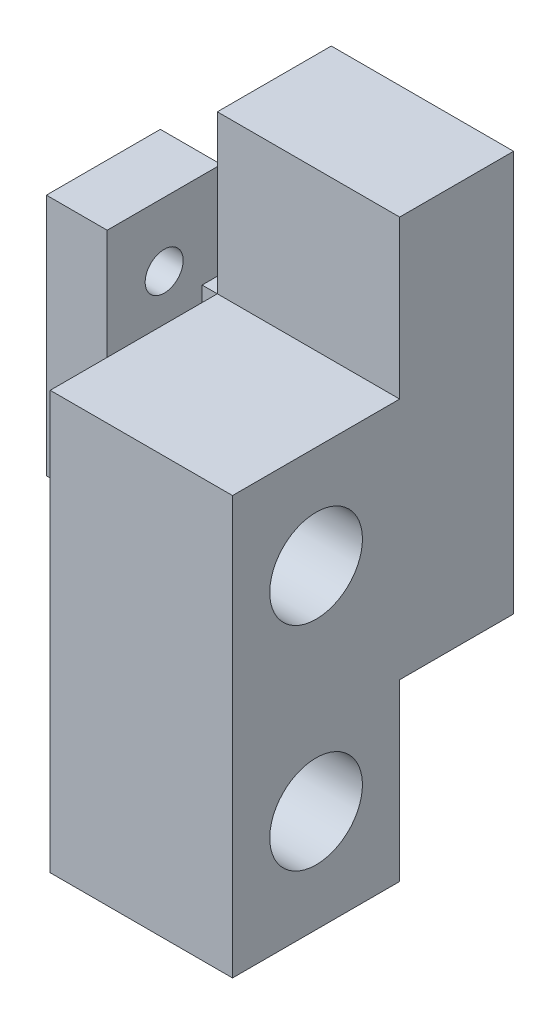
ISO-10303-21;
HEADER;
FILE_DESCRIPTION(('STEP AP214'),'2;1');
FILE_NAME('part.step','',(''),(''),'','','');
FILE_SCHEMA(('AUTOMOTIVE_DESIGN { 1 0 10303 214 1 1 1 1 }'));
ENDSEC;
DATA;
#1=APPLICATION_CONTEXT('core data for automotive mechanical design processes');
#2=APPLICATION_PROTOCOL_DEFINITION('international standard','automotive_design',2000,#1);
#3=PRODUCT_CONTEXT('',#1,'mechanical');
#4=PRODUCT('Part','Part','',(#3));
#5=PRODUCT_RELATED_PRODUCT_CATEGORY('part','',(#4));
#6=PRODUCT_DEFINITION_FORMATION('','',#4);
#7=PRODUCT_DEFINITION_CONTEXT('part definition',#1,'design');
#8=PRODUCT_DEFINITION('design','',#6,#7);
#9=PRODUCT_DEFINITION_SHAPE('','',#8);
#10=(LENGTH_UNIT() NAMED_UNIT(*) SI_UNIT(.MILLI.,.METRE.));
#11=(NAMED_UNIT(*) PLANE_ANGLE_UNIT() SI_UNIT($,.RADIAN.));
#12=(NAMED_UNIT(*) SI_UNIT($,.STERADIAN.) SOLID_ANGLE_UNIT());
#13=UNCERTAINTY_MEASURE_WITH_UNIT(LENGTH_MEASURE(1.E-05),#10,'distance_accuracy_value','');
#14=(GEOMETRIC_REPRESENTATION_CONTEXT(3) GLOBAL_UNCERTAINTY_ASSIGNED_CONTEXT((#13)) GLOBAL_UNIT_ASSIGNED_CONTEXT((#10,
#11,#12)) REPRESENTATION_CONTEXT('',''));
#15=CARTESIAN_POINT('',(0.,0.,0.));
#16=DIRECTION('',(0.,0.,1.));
#17=DIRECTION('',(1.,0.,0.));
#18=AXIS2_PLACEMENT_3D('',#15,#16,#17);
#19=CARTESIAN_POINT('',(0.,0.,15.));
#20=DIRECTION('',(0.,0.,1.));
#21=DIRECTION('',(1.,0.,0.));
#22=AXIS2_PLACEMENT_3D('',#19,#20,#21);
#23=PLANE('',#22);
#24=DIRECTION('',(0.,-1.,0.));
#25=VECTOR('',#24,1.);
#26=CARTESIAN_POINT('',(-49.8004880602594,0.,15.));
#27=LINE('',#26,#25);
#28=CARTESIAN_POINT('',(-49.8004880602594,16.7742765528327,15.));
#29=VERTEX_POINT('',#28);
#30=CARTESIAN_POINT('',(-49.8004880602594,-15.2257234471673,15.));
#31=VERTEX_POINT('',#30);
#32=EDGE_CURVE('E326',#29,#31,#27,.T.);
#33=ORIENTED_EDGE('',*,*,#32,.F.);
#34=DIRECTION('',(-1.,0.,0.));
#35=VECTOR('',#34,1.);
#36=CARTESIAN_POINT('',(-51.8005116722408,16.7742765528327,15.));
#37=LINE('',#36,#35);
#38=CARTESIAN_POINT('',(-51.8005116722408,16.7742765528327,15.));
#39=VERTEX_POINT('',#38);
#40=EDGE_CURVE('E198',#29,#39,#37,.T.);
#41=ORIENTED_EDGE('',*,*,#40,.T.);
#42=DIRECTION('',(0.,-1.,0.));
#43=VECTOR('',#42,1.);
#44=CARTESIAN_POINT('',(-51.8005116722408,-7.22572344716734,15.));
#45=LINE('',#44,#43);
#46=CARTESIAN_POINT('',(-51.8005116722408,-7.22572344716734,15.));
#47=VERTEX_POINT('',#46);
#48=EDGE_CURVE('E222',#39,#47,#45,.T.);
#49=ORIENTED_EDGE('',*,*,#48,.T.);
#50=DIRECTION('',(-1.,0.,0.));
#51=VECTOR('',#50,1.);
#52=CARTESIAN_POINT('',(-64.3005116722456,-7.22572344716734,15.));
#53=LINE('',#52,#51);
#54=CARTESIAN_POINT('',(-64.3005116722456,-7.22572344716734,15.));
#55=VERTEX_POINT('',#54);
#56=EDGE_CURVE('E226',#47,#55,#53,.T.);
#57=ORIENTED_EDGE('',*,*,#56,.T.);
#58=DIRECTION('',(0.,1.,0.));
#59=VECTOR('',#58,1.);
#60=CARTESIAN_POINT('',(-64.3005116722456,16.7742765528327,15.));
#61=LINE('',#60,#59);
#62=CARTESIAN_POINT('',(-64.3005116722456,16.7742765528327,15.));
#63=VERTEX_POINT('',#62);
#64=EDGE_CURVE('E230',#55,#63,#61,.T.);
#65=ORIENTED_EDGE('',*,*,#64,.T.);
#66=DIRECTION('',(-1.,0.,0.));
#67=VECTOR('',#66,1.);
#68=CARTESIAN_POINT('',(-64.3005116722456,16.7742765528327,15.));
#69=LINE('',#68,#67);
#70=CARTESIAN_POINT('',(-72.3005116722456,16.7742765528327,15.));
#71=VERTEX_POINT('',#70);
#72=EDGE_CURVE('E234',#63,#71,#69,.T.);
#73=ORIENTED_EDGE('',*,*,#72,.T.);
#74=DIRECTION('',(0.,-1.,0.));
#75=VECTOR('',#74,1.);
#76=CARTESIAN_POINT('',(-72.3005116722456,16.7742765528327,15.));
#77=LINE('',#76,#75);
#78=CARTESIAN_POINT('',(-72.3005116722456,-15.2257234471673,15.));
#79=VERTEX_POINT('',#78);
#80=EDGE_CURVE('E238',#71,#79,#77,.T.);
#81=ORIENTED_EDGE('',*,*,#80,.T.);
#82=DIRECTION('',(1.,0.,0.));
#83=VECTOR('',#82,1.);
#84=CARTESIAN_POINT('',(-72.3005116722456,-15.2257234471673,15.));
#85=LINE('',#84,#83);
#86=EDGE_CURVE('E242',#79,#31,#85,.T.);
#87=ORIENTED_EDGE('',*,*,#86,.T.);
#88=EDGE_LOOP('',(#33,#41,#49,#57,#65,#73,#81,#87));
#89=FACE_BOUND('',#88,.T.);
#90=ADVANCED_FACE('F45',(#89),#23,.T.);
#91=CARTESIAN_POINT('',(-37.800488060268,25.5242765528339,15.));
#92=DIRECTION('',(0.,0.,-1.));
#93=DIRECTION('',(-1.,0.,0.));
#94=AXIS2_PLACEMENT_3D('',#91,#92,#93);
#95=CYLINDRICAL_SURFACE('',#94,3.1);
#96=CARTESIAN_POINT('',(-37.800488060268,25.5242765528339,0.));
#97=DIRECTION('',(0.,0.,1.));
#98=DIRECTION('',(1.,0.,0.));
#99=AXIS2_PLACEMENT_3D('',#96,#97,#98);
#100=CIRCLE('',#99,3.1);
#101=CARTESIAN_POINT('',(-34.700488060268,25.5242765528339,0.));
#102=VERTEX_POINT('',#101);
#103=EDGE_CURVE('E276',#102,#102,#100,.T.);
#104=ORIENTED_EDGE('',*,*,#103,.F.);
#105=EDGE_LOOP('',(#104));
#106=FACE_BOUND('',#105,.T.);
#107=CARTESIAN_POINT('',(-37.800488060268,25.5242765528339,10.));
#108=DIRECTION('',(0.,0.,1.));
#109=DIRECTION('',(1.,0.,0.));
#110=AXIS2_PLACEMENT_3D('',#107,#108,#109);
#111=CIRCLE('',#110,3.1);
#112=CARTESIAN_POINT('',(-34.700488060268,25.5242765528339,10.));
#113=VERTEX_POINT('',#112);
#114=EDGE_CURVE('E268',#113,#113,#111,.T.);
#115=ORIENTED_EDGE('',*,*,#114,.T.);
#116=EDGE_LOOP('',(#115));
#117=FACE_BOUND('',#116,.T.);
#118=ADVANCED_FACE('F47',(#106,#117),#95,.F.);
#119=CARTESIAN_POINT('',(-37.8004880602594,-2.97572344716154,15.));
#120=DIRECTION('',(0.,0.,-1.));
#121=DIRECTION('',(-1.,0.,0.));
#122=AXIS2_PLACEMENT_3D('',#119,#120,#121);
#123=CYLINDRICAL_SURFACE('',#122,3.1);
#124=CARTESIAN_POINT('',(-37.8004880602594,-2.97572344716154,0.));
#125=DIRECTION('',(0.,0.,1.));
#126=DIRECTION('',(1.,0.,0.));
#127=AXIS2_PLACEMENT_3D('',#124,#125,#126);
#128=CIRCLE('',#127,3.1);
#129=CARTESIAN_POINT('',(-34.7004880602594,-2.97572344716154,0.));
#130=VERTEX_POINT('',#129);
#131=EDGE_CURVE('E289',#130,#130,#128,.T.);
#132=ORIENTED_EDGE('',*,*,#131,.F.);
#133=EDGE_LOOP('',(#132));
#134=FACE_BOUND('',#133,.T.);
#135=CARTESIAN_POINT('',(-37.8004880602594,-2.97572344716154,10.));
#136=DIRECTION('',(0.,0.,1.));
#137=DIRECTION('',(1.,0.,0.));
#138=AXIS2_PLACEMENT_3D('',#135,#136,#137);
#139=CIRCLE('',#138,3.1);
#140=CARTESIAN_POINT('',(-34.7004880602594,-2.97572344716154,10.));
#141=VERTEX_POINT('',#140);
#142=EDGE_CURVE('E272',#141,#141,#139,.T.);
#143=ORIENTED_EDGE('',*,*,#142,.T.);
#144=EDGE_LOOP('',(#143));
#145=FACE_BOUND('',#144,.T.);
#146=ADVANCED_FACE('F400',(#134,#145),#123,.F.);
#147=CARTESIAN_POINT('',(-25.8004880602594,0.,15.));
#148=DIRECTION('',(-1.,0.,0.));
#149=DIRECTION('',(0.,-1.,0.));
#150=AXIS2_PLACEMENT_3D('',#147,#148,#149);
#151=PLANE('',#150);
#152=CARTESIAN_POINT('',(-25.8004880602594,3.27427655283267,26.));
#153=DIRECTION('',(-1.,0.,0.));
#154=DIRECTION('',(0.,-1.,0.));
#155=AXIS2_PLACEMENT_3D('',#152,#153,#154);
#156=CIRCLE('',#155,6.1);
#157=CARTESIAN_POINT('',(-25.8004880602594,-2.82572344716733,26.));
#158=VERTEX_POINT('',#157);
#159=EDGE_CURVE('E346',#158,#158,#156,.T.);
#160=ORIENTED_EDGE('',*,*,#159,.T.);
#161=EDGE_LOOP('',(#160));
#162=FACE_BOUND('',#161,.T.);
#163=CARTESIAN_POINT('',(-25.8004880602594,-24.7257234471673,26.));
#164=DIRECTION('',(-1.,0.,0.));
#165=DIRECTION('',(0.,-1.,0.));
#166=AXIS2_PLACEMENT_3D('',#163,#164,#165);
#167=CIRCLE('',#166,6.1);
#168=CARTESIAN_POINT('',(-25.8004880602594,-30.8257234471673,26.));
#169=VERTEX_POINT('',#168);
#170=EDGE_CURVE('E510',#169,#169,#167,.T.);
#171=ORIENTED_EDGE('',*,*,#170,.T.);
#172=EDGE_LOOP('',(#171));
#173=FACE_BOUND('',#172,.T.);
#174=DIRECTION('',(0.,1.,0.));
#175=VECTOR('',#174,1.);
#176=CARTESIAN_POINT('',(-25.8004880602594,0.,0.));
#177=LINE('',#176,#175);
#178=CARTESIAN_POINT('',(-25.8004880602594,-15.2257234471673,0.));
#179=VERTEX_POINT('',#178);
#180=CARTESIAN_POINT('',(-25.8004880602594,37.5242765528386,0.));
#181=VERTEX_POINT('',#180);
#182=EDGE_CURVE('E293',#179,#181,#177,.T.);
#183=ORIENTED_EDGE('',*,*,#182,.T.);
#184=DIRECTION('',(0.,0.,-1.));
#185=VECTOR('',#184,1.);
#186=CARTESIAN_POINT('',(-25.8004880602594,37.5242765528386,15.));
#187=LINE('',#186,#185);
#188=CARTESIAN_POINT('',(-25.8004880602594,37.5242765528386,15.));
#189=VERTEX_POINT('',#188);
#190=EDGE_CURVE('E11',#189,#181,#187,.T.);
#191=ORIENTED_EDGE('',*,*,#190,.F.);
#192=DIRECTION('',(0.,1.,0.));
#193=VECTOR('',#192,1.);
#194=CARTESIAN_POINT('',(-25.8004880602594,0.,15.));
#195=LINE('',#194,#193);
#196=CARTESIAN_POINT('',(-25.8004880602594,16.7742765528327,15.));
#197=VERTEX_POINT('',#196);
#198=EDGE_CURVE('E175',#197,#189,#195,.T.);
#199=ORIENTED_EDGE('',*,*,#198,.F.);
#200=DIRECTION('',(0.,0.,-1.));
#201=VECTOR('',#200,1.);
#202=CARTESIAN_POINT('',(-25.8004880602594,16.7742765528327,37.));
#203=LINE('',#202,#201);
#204=CARTESIAN_POINT('',(-25.8004880602594,16.7742765528327,37.));
#205=VERTEX_POINT('',#204);
#206=EDGE_CURVE('E153',#205,#197,#203,.T.);
#207=ORIENTED_EDGE('',*,*,#206,.F.);
#208=DIRECTION('',(0.,1.,0.));
#209=VECTOR('',#208,1.);
#210=CARTESIAN_POINT('',(-25.8004880602594,0.,37.));
#211=LINE('',#210,#209);
#212=CARTESIAN_POINT('',(-25.8004880602594,-38.2257234471673,37.));
#213=VERTEX_POINT('',#212);
#214=EDGE_CURVE('E160',#213,#205,#211,.T.);
#215=ORIENTED_EDGE('',*,*,#214,.F.);
#216=DIRECTION('',(0.,0.,-1.));
#217=VECTOR('',#216,1.);
#218=CARTESIAN_POINT('',(-25.8004880602594,-38.2257234471673,37.));
#219=LINE('',#218,#217);
#220=CARTESIAN_POINT('',(-25.8004880602594,-38.2257234471673,15.));
#221=VERTEX_POINT('',#220);
#222=EDGE_CURVE('E341',#213,#221,#219,.T.);
#223=ORIENTED_EDGE('',*,*,#222,.T.);
#224=DIRECTION('',(0.,1.,0.));
#225=VECTOR('',#224,1.);
#226=CARTESIAN_POINT('',(-25.8004880602594,0.,15.));
#227=LINE('',#226,#225);
#228=CARTESIAN_POINT('',(-25.8004880602594,-15.2257234471673,15.));
#229=VERTEX_POINT('',#228);
#230=EDGE_CURVE('E333',#221,#229,#227,.T.);
#231=ORIENTED_EDGE('',*,*,#230,.T.);
#232=DIRECTION('',(0.,0.,1.));
#233=VECTOR('',#232,1.);
#234=CARTESIAN_POINT('',(-25.8004880602594,-15.2257234471673,-24.001302048014));
#235=LINE('',#234,#233);
#236=EDGE_CURVE('E177',#179,#229,#235,.T.);
#237=ORIENTED_EDGE('',*,*,#236,.F.);
#238=EDGE_LOOP('',(#183,#191,#199,#207,#215,#223,#231,#237));
#239=FACE_BOUND('',#238,.T.);
#240=ADVANCED_FACE('F173',(#162,#173,#239),#151,.F.);
#241=CARTESIAN_POINT('',(0.,37.5242765528386,15.));
#242=DIRECTION('',(0.,-1.,0.));
#243=DIRECTION('',(0.,0.,-1.));
#244=AXIS2_PLACEMENT_3D('',#241,#242,#243);
#245=PLANE('',#244);
#246=DIRECTION('',(-1.,0.,0.));
#247=VECTOR('',#246,1.);
#248=CARTESIAN_POINT('',(0.,37.5242765528386,0.));
#249=LINE('',#248,#247);
#250=CARTESIAN_POINT('',(-49.8004880602594,37.5242765528386,0.));
#251=VERTEX_POINT('',#250);
#252=EDGE_CURVE('E296',#181,#251,#249,.T.);
#253=ORIENTED_EDGE('',*,*,#252,.T.);
#254=DIRECTION('',(0.,0.,-1.));
#255=VECTOR('',#254,1.);
#256=CARTESIAN_POINT('',(-49.8004880602594,37.5242765528386,15.));
#257=LINE('',#256,#255);
#258=CARTESIAN_POINT('',(-49.8004880602594,37.5242765528386,15.));
#259=VERTEX_POINT('',#258);
#260=EDGE_CURVE('E55',#259,#251,#257,.T.);
#261=ORIENTED_EDGE('',*,*,#260,.F.);
#262=DIRECTION('',(-1.,0.,0.));
#263=VECTOR('',#262,1.);
#264=CARTESIAN_POINT('',(0.,37.5242765528386,15.));
#265=LINE('',#264,#263);
#266=EDGE_CURVE('E279',#189,#259,#265,.T.);
#267=ORIENTED_EDGE('',*,*,#266,.F.);
#268=ORIENTED_EDGE('',*,*,#190,.T.);
#269=EDGE_LOOP('',(#253,#261,#267,#268));
#270=FACE_BOUND('',#269,.T.);
#271=ADVANCED_FACE('F410',(#270),#245,.F.);
#272=CARTESIAN_POINT('',(-49.8004880602594,0.,15.));
#273=DIRECTION('',(1.,0.,0.));
#274=DIRECTION('',(0.,1.,0.));
#275=AXIS2_PLACEMENT_3D('',#272,#273,#274);
#276=PLANE('',#275);
#277=DIRECTION('',(0.,-1.,0.));
#278=VECTOR('',#277,1.);
#279=CARTESIAN_POINT('',(-49.8004880602594,0.,0.));
#280=LINE('',#279,#278);
#281=CARTESIAN_POINT('',(-49.8004880602594,16.7742765528327,0.));
#282=VERTEX_POINT('',#281);
#283=EDGE_CURVE('E280',#251,#282,#280,.T.);
#284=ORIENTED_EDGE('',*,*,#283,.T.);
#285=DIRECTION('',(0.,0.,1.));
#286=VECTOR('',#285,1.);
#287=CARTESIAN_POINT('',(-49.8004880602594,16.7742765528327,-39.1184235692076));
#288=LINE('',#287,#286);
#289=EDGE_CURVE('E245',#282,#29,#288,.T.);
#290=ORIENTED_EDGE('',*,*,#289,.T.);
#291=DIRECTION('',(0.,-1.,0.));
#292=VECTOR('',#291,1.);
#293=CARTESIAN_POINT('',(-49.8004880602594,0.,15.));
#294=LINE('',#293,#292);
#295=EDGE_CURVE('E283',#259,#29,#294,.T.);
#296=ORIENTED_EDGE('',*,*,#295,.F.);
#297=ORIENTED_EDGE('',*,*,#260,.T.);
#298=EDGE_LOOP('',(#284,#290,#296,#297));
#299=FACE_BOUND('',#298,.T.);
#300=ADVANCED_FACE('F308',(#299),#276,.F.);
#301=DIRECTION('',(-1.,0.,0.));
#302=VECTOR('',#301,1.);
#303=CARTESIAN_POINT('',(0.,16.7742765528327,15.));
#304=LINE('',#303,#302);
#305=EDGE_CURVE('E62',#197,#29,#304,.T.);
#306=ORIENTED_EDGE('',*,*,#305,.F.);
#307=ORIENTED_EDGE('',*,*,#198,.T.);
#308=ORIENTED_EDGE('',*,*,#266,.T.);
#309=ORIENTED_EDGE('',*,*,#295,.T.);
#310=EDGE_LOOP('',(#306,#307,#308,#309));
#311=FACE_BOUND('',#310,.T.);
#312=ADVANCED_FACE('F396',(#311),#23,.T.);
#313=CARTESIAN_POINT('',(0.,0.,0.));
#314=DIRECTION('',(0.,0.,1.));
#315=DIRECTION('',(1.,0.,0.));
#316=AXIS2_PLACEMENT_3D('',#313,#314,#315);
#317=PLANE('',#316);
#318=ORIENTED_EDGE('',*,*,#182,.F.);
#319=DIRECTION('',(-1.,0.,0.));
#320=VECTOR('',#319,1.);
#321=CARTESIAN_POINT('',(-72.3005116722456,-15.2257234471673,0.));
#322=LINE('',#321,#320);
#323=CARTESIAN_POINT('',(-72.3005116722456,-15.2257234471673,0.));
#324=VERTEX_POINT('',#323);
#325=EDGE_CURVE('E215',#179,#324,#322,.T.);
#326=ORIENTED_EDGE('',*,*,#325,.T.);
#327=DIRECTION('',(0.,1.,0.));
#328=VECTOR('',#327,1.);
#329=CARTESIAN_POINT('',(-72.3005116722456,16.7742765528327,0.));
#330=LINE('',#329,#328);
#331=CARTESIAN_POINT('',(-72.3005116722456,16.7742765528327,0.));
#332=VERTEX_POINT('',#331);
#333=EDGE_CURVE('E212',#324,#332,#330,.T.);
#334=ORIENTED_EDGE('',*,*,#333,.T.);
#335=DIRECTION('',(1.,0.,0.));
#336=VECTOR('',#335,1.);
#337=CARTESIAN_POINT('',(-64.3005116722456,16.7742765528327,0.));
#338=LINE('',#337,#336);
#339=CARTESIAN_POINT('',(-64.3005116722456,16.7742765528327,0.));
#340=VERTEX_POINT('',#339);
#341=EDGE_CURVE('E209',#332,#340,#338,.T.);
#342=ORIENTED_EDGE('',*,*,#341,.T.);
#343=DIRECTION('',(0.,-1.,0.));
#344=VECTOR('',#343,1.);
#345=CARTESIAN_POINT('',(-64.3005116722456,16.7742765528327,0.));
#346=LINE('',#345,#344);
#347=CARTESIAN_POINT('',(-64.3005116722456,-7.22572344716734,0.));
#348=VERTEX_POINT('',#347);
#349=EDGE_CURVE('E206',#340,#348,#346,.T.);
#350=ORIENTED_EDGE('',*,*,#349,.T.);
#351=DIRECTION('',(1.,0.,0.));
#352=VECTOR('',#351,1.);
#353=CARTESIAN_POINT('',(-64.3005116722456,-7.22572344716734,0.));
#354=LINE('',#353,#352);
#355=CARTESIAN_POINT('',(-51.8005116722408,-7.22572344716734,0.));
#356=VERTEX_POINT('',#355);
#357=EDGE_CURVE('E202',#348,#356,#354,.T.);
#358=ORIENTED_EDGE('',*,*,#357,.T.);
#359=DIRECTION('',(0.,1.,0.));
#360=VECTOR('',#359,1.);
#361=CARTESIAN_POINT('',(-51.8005116722408,-7.22572344716734,0.));
#362=LINE('',#361,#360);
#363=CARTESIAN_POINT('',(-51.8005116722408,16.7742765528327,0.));
#364=VERTEX_POINT('',#363);
#365=EDGE_CURVE('E199',#356,#364,#362,.T.);
#366=ORIENTED_EDGE('',*,*,#365,.T.);
#367=DIRECTION('',(1.,0.,0.));
#368=VECTOR('',#367,1.);
#369=CARTESIAN_POINT('',(-51.8005116722408,16.7742765528327,0.));
#370=LINE('',#369,#368);
#371=EDGE_CURVE('E218',#364,#282,#370,.T.);
#372=ORIENTED_EDGE('',*,*,#371,.T.);
#373=ORIENTED_EDGE('',*,*,#283,.F.);
#374=ORIENTED_EDGE('',*,*,#252,.F.);
#375=EDGE_LOOP('',(#318,#326,#334,#342,#350,#358,#366,#372,#373,#374));
#376=FACE_BOUND('',#375,.T.);
#377=ORIENTED_EDGE('',*,*,#103,.T.);
#378=EDGE_LOOP('',(#377));
#379=FACE_BOUND('',#378,.T.);
#380=ORIENTED_EDGE('',*,*,#131,.T.);
#381=EDGE_LOOP('',(#380));
#382=FACE_BOUND('',#381,.T.);
#383=ADVANCED_FACE('F313',(#376,#379,#382),#317,.F.);
#384=CARTESIAN_POINT('',(-37.8004880602594,-2.97572344716154,10.));
#385=DIRECTION('',(0.,0.,1.));
#386=DIRECTION('',(1.,0.,0.));
#387=AXIS2_PLACEMENT_3D('',#384,#385,#386);
#388=PLANE('',#387);
#389=ORIENTED_EDGE('',*,*,#142,.F.);
#390=EDGE_LOOP('',(#389));
#391=FACE_BOUND('',#390,.T.);
#392=ADVANCED_FACE('F409',(#391),#388,.F.);
#393=CARTESIAN_POINT('',(-37.800488060268,25.5242765528339,10.));
#394=DIRECTION('',(0.,0.,1.));
#395=DIRECTION('',(1.,0.,0.));
#396=AXIS2_PLACEMENT_3D('',#393,#394,#395);
#397=PLANE('',#396);
#398=ORIENTED_EDGE('',*,*,#114,.F.);
#399=EDGE_LOOP('',(#398));
#400=FACE_BOUND('',#399,.T.);
#401=ADVANCED_FACE('F428',(#400),#397,.F.);
#402=CARTESIAN_POINT('',(-72.3005116722456,-15.2257234471673,-39.1184235692076));
#403=DIRECTION('',(0.,-1.,0.));
#404=DIRECTION('',(1.,0.,0.));
#405=AXIS2_PLACEMENT_3D('',#402,#403,#404);
#406=PLANE('',#405);
#407=ORIENTED_EDGE('',*,*,#325,.F.);
#408=ORIENTED_EDGE('',*,*,#236,.T.);
#409=EDGE_CURVE('E70',#31,#229,#85,.T.);
#410=ORIENTED_EDGE('',*,*,#409,.F.);
#411=ORIENTED_EDGE('',*,*,#86,.F.);
#412=DIRECTION('',(0.,0.,1.));
#413=VECTOR('',#412,1.);
#414=CARTESIAN_POINT('',(-72.3005116722456,-15.2257234471673,-39.1184235692076));
#415=LINE('',#414,#413);
#416=EDGE_CURVE('E203',#324,#79,#415,.T.);
#417=ORIENTED_EDGE('',*,*,#416,.F.);
#418=EDGE_LOOP('',(#407,#408,#410,#411,#417));
#419=FACE_BOUND('',#418,.T.);
#420=ADVANCED_FACE('F359',(#419),#406,.T.);
#421=CARTESIAN_POINT('',(-72.3005116722456,16.7742765528327,-39.1184235692076));
#422=DIRECTION('',(-1.,0.,0.));
#423=DIRECTION('',(0.,0.,1.));
#424=AXIS2_PLACEMENT_3D('',#421,#422,#423);
#425=PLANE('',#424);
#426=CARTESIAN_POINT('',(-72.3005116722456,8.3467828211485,7.5));
#427=DIRECTION('',(-1.,0.,0.));
#428=DIRECTION('',(0.,0.,1.));
#429=AXIS2_PLACEMENT_3D('',#426,#427,#428);
#430=CIRCLE('',#429,2.5);
#431=CARTESIAN_POINT('',(-72.3005116722456,8.3467828211485,10.));
#432=VERTEX_POINT('',#431);
#433=EDGE_CURVE('E181',#432,#432,#430,.T.);
#434=ORIENTED_EDGE('',*,*,#433,.F.);
#435=EDGE_LOOP('',(#434));
#436=FACE_BOUND('',#435,.T.);
#437=ORIENTED_EDGE('',*,*,#333,.F.);
#438=ORIENTED_EDGE('',*,*,#416,.T.);
#439=ORIENTED_EDGE('',*,*,#80,.F.);
#440=DIRECTION('',(0.,0.,1.));
#441=VECTOR('',#440,1.);
#442=CARTESIAN_POINT('',(-72.3005116722456,16.7742765528327,-39.1184235692076));
#443=LINE('',#442,#441);
#444=EDGE_CURVE('E248',#332,#71,#443,.T.);
#445=ORIENTED_EDGE('',*,*,#444,.F.);
#446=EDGE_LOOP('',(#437,#438,#439,#445));
#447=FACE_BOUND('',#446,.T.);
#448=ADVANCED_FACE('F365',(#436,#447),#425,.T.);
#449=CARTESIAN_POINT('',(-64.3005116722456,16.7742765528327,-39.1184235692076));
#450=DIRECTION('',(0.,1.,0.));
#451=DIRECTION('',(-1.,0.,0.));
#452=AXIS2_PLACEMENT_3D('',#449,#450,#451);
#453=PLANE('',#452);
#454=ORIENTED_EDGE('',*,*,#341,.F.);
#455=ORIENTED_EDGE('',*,*,#444,.T.);
#456=ORIENTED_EDGE('',*,*,#72,.F.);
#457=DIRECTION('',(0.,0.,1.));
#458=VECTOR('',#457,1.);
#459=CARTESIAN_POINT('',(-64.3005116722456,16.7742765528327,-39.1184235692076));
#460=LINE('',#459,#458);
#461=EDGE_CURVE('E251',#340,#63,#460,.T.);
#462=ORIENTED_EDGE('',*,*,#461,.F.);
#463=EDGE_LOOP('',(#454,#455,#456,#462));
#464=FACE_BOUND('',#463,.T.);
#465=ADVANCED_FACE('F369',(#464),#453,.T.);
#466=CARTESIAN_POINT('',(-64.3005116722456,16.7742765528327,-39.1184235692076));
#467=DIRECTION('',(1.,0.,0.));
#468=DIRECTION('',(0.,0.,-1.));
#469=AXIS2_PLACEMENT_3D('',#466,#467,#468);
#470=PLANE('',#469);
#471=CARTESIAN_POINT('',(-64.3005116722456,8.3467828211485,7.5));
#472=DIRECTION('',(1.,0.,0.));
#473=DIRECTION('',(0.,0.,-1.));
#474=AXIS2_PLACEMENT_3D('',#471,#472,#473);
#475=CIRCLE('',#474,2.5);
#476=CARTESIAN_POINT('',(-64.3005116722456,8.3467828211485,5.));
#477=VERTEX_POINT('',#476);
#478=EDGE_CURVE('E194',#477,#477,#475,.T.);
#479=ORIENTED_EDGE('',*,*,#478,.F.);
#480=EDGE_LOOP('',(#479));
#481=FACE_BOUND('',#480,.T.);
#482=ORIENTED_EDGE('',*,*,#349,.F.);
#483=ORIENTED_EDGE('',*,*,#461,.T.);
#484=ORIENTED_EDGE('',*,*,#64,.F.);
#485=DIRECTION('',(0.,0.,1.));
#486=VECTOR('',#485,1.);
#487=CARTESIAN_POINT('',(-64.3005116722456,-7.22572344716734,-39.1184235692076));
#488=LINE('',#487,#486);
#489=EDGE_CURVE('E254',#348,#55,#488,.T.);
#490=ORIENTED_EDGE('',*,*,#489,.F.);
#491=EDGE_LOOP('',(#482,#483,#484,#490));
#492=FACE_BOUND('',#491,.T.);
#493=ADVANCED_FACE('F375',(#481,#492),#470,.T.);
#494=CARTESIAN_POINT('',(-64.3005116722456,-7.22572344716734,-39.1184235692076));
#495=DIRECTION('',(0.,1.,0.));
#496=DIRECTION('',(0.,0.,1.));
#497=AXIS2_PLACEMENT_3D('',#494,#495,#496);
#498=PLANE('',#497);
#499=ORIENTED_EDGE('',*,*,#357,.F.);
#500=ORIENTED_EDGE('',*,*,#489,.T.);
#501=ORIENTED_EDGE('',*,*,#56,.F.);
#502=DIRECTION('',(0.,0.,1.));
#503=VECTOR('',#502,1.);
#504=CARTESIAN_POINT('',(-51.8005116722408,-7.22572344716734,-39.1184235692076));
#505=LINE('',#504,#503);
#506=EDGE_CURVE('E257',#356,#47,#505,.T.);
#507=ORIENTED_EDGE('',*,*,#506,.F.);
#508=EDGE_LOOP('',(#499,#500,#501,#507));
#509=FACE_BOUND('',#508,.T.);
#510=ADVANCED_FACE('F379',(#509),#498,.T.);
#511=CARTESIAN_POINT('',(-51.8005116722408,-7.22572344716734,-39.1184235692076));
#512=DIRECTION('',(-1.,0.,0.));
#513=DIRECTION('',(0.,0.,1.));
#514=AXIS2_PLACEMENT_3D('',#511,#512,#513);
#515=PLANE('',#514);
#516=CARTESIAN_POINT('',(-51.8005116722408,8.3467828211485,7.5));
#517=DIRECTION('',(-1.,0.,0.));
#518=DIRECTION('',(0.,0.,1.));
#519=AXIS2_PLACEMENT_3D('',#516,#517,#518);
#520=CIRCLE('',#519,2.5);
#521=CARTESIAN_POINT('',(-51.8005116722408,8.3467828211485,10.));
#522=VERTEX_POINT('',#521);
#523=EDGE_CURVE('E49',#522,#522,#520,.T.);
#524=ORIENTED_EDGE('',*,*,#523,.F.);
#525=EDGE_LOOP('',(#524));
#526=FACE_BOUND('',#525,.T.);
#527=ORIENTED_EDGE('',*,*,#365,.F.);
#528=ORIENTED_EDGE('',*,*,#506,.T.);
#529=ORIENTED_EDGE('',*,*,#48,.F.);
#530=DIRECTION('',(0.,0.,1.));
#531=VECTOR('',#530,1.);
#532=CARTESIAN_POINT('',(-51.8005116722408,16.7742765528327,-39.1184235692076));
#533=LINE('',#532,#531);
#534=EDGE_CURVE('E260',#364,#39,#533,.T.);
#535=ORIENTED_EDGE('',*,*,#534,.F.);
#536=EDGE_LOOP('',(#527,#528,#529,#535));
#537=FACE_BOUND('',#536,.T.);
#538=ADVANCED_FACE('F382',(#526,#537),#515,.T.);
#539=CARTESIAN_POINT('',(-51.8005116722408,16.7742765528327,-39.1184235692076));
#540=DIRECTION('',(0.,1.,0.));
#541=DIRECTION('',(0.,0.,1.));
#542=AXIS2_PLACEMENT_3D('',#539,#540,#541);
#543=PLANE('',#542);
#544=ORIENTED_EDGE('',*,*,#371,.F.);
#545=ORIENTED_EDGE('',*,*,#534,.T.);
#546=ORIENTED_EDGE('',*,*,#40,.F.);
#547=ORIENTED_EDGE('',*,*,#289,.F.);
#548=EDGE_LOOP('',(#544,#545,#546,#547));
#549=FACE_BOUND('',#548,.T.);
#550=ADVANCED_FACE('F321',(#549),#543,.T.);
#551=CARTESIAN_POINT('',(-47.3005116722456,8.3467828211485,7.5));
#552=DIRECTION('',(-1.,0.,0.));
#553=DIRECTION('',(0.,0.,1.));
#554=AXIS2_PLACEMENT_3D('',#551,#552,#553);
#555=PLANE('',#554);
#556=CARTESIAN_POINT('',(-47.3005116722456,8.3467828211485,7.5));
#557=DIRECTION('',(-1.,0.,0.));
#558=DIRECTION('',(0.,0.,1.));
#559=AXIS2_PLACEMENT_3D('',#556,#557,#558);
#560=CIRCLE('',#559,2.5);
#561=CARTESIAN_POINT('',(-47.3005116722456,8.3467828211485,10.));
#562=VERTEX_POINT('',#561);
#563=EDGE_CURVE('E187',#562,#562,#560,.T.);
#564=ORIENTED_EDGE('',*,*,#563,.T.);
#565=EDGE_LOOP('',(#564));
#566=FACE_BOUND('',#565,.T.);
#567=ADVANCED_FACE('F390',(#566),#555,.T.);
#568=CARTESIAN_POINT('',(-47.3005116722456,8.3467828211485,7.5));
#569=DIRECTION('',(-1.,0.,0.));
#570=DIRECTION('',(0.,0.,1.));
#571=AXIS2_PLACEMENT_3D('',#568,#569,#570);
#572=CYLINDRICAL_SURFACE('',#571,2.5);
#573=ORIENTED_EDGE('',*,*,#523,.T.);
#574=EDGE_LOOP('',(#573));
#575=FACE_BOUND('',#574,.T.);
#576=ORIENTED_EDGE('',*,*,#563,.F.);
#577=EDGE_LOOP('',(#576));
#578=FACE_BOUND('',#577,.T.);
#579=ADVANCED_FACE('F446',(#575,#578),#572,.F.);
#580=ORIENTED_EDGE('',*,*,#478,.T.);
#581=EDGE_LOOP('',(#580));
#582=FACE_BOUND('',#581,.T.);
#583=ORIENTED_EDGE('',*,*,#433,.T.);
#584=EDGE_LOOP('',(#583));
#585=FACE_BOUND('',#584,.T.);
#586=ADVANCED_FACE('F457',(#582,#585),#572,.F.);
#587=CARTESIAN_POINT('',(0.,0.,15.));
#588=DIRECTION('',(0.,0.,1.));
#589=DIRECTION('',(1.,0.,0.));
#590=AXIS2_PLACEMENT_3D('',#587,#588,#589);
#591=PLANE('',#590);
#592=CARTESIAN_POINT('',(-49.8004880602594,-38.2257234471673,15.));
#593=VERTEX_POINT('',#592);
#594=EDGE_CURVE('E330',#31,#593,#27,.T.);
#595=ORIENTED_EDGE('',*,*,#594,.F.);
#596=ORIENTED_EDGE('',*,*,#409,.T.);
#597=ORIENTED_EDGE('',*,*,#230,.F.);
#598=DIRECTION('',(1.,0.,0.));
#599=VECTOR('',#598,1.);
#600=CARTESIAN_POINT('',(0.,-38.2257234471673,15.));
#601=LINE('',#600,#599);
#602=EDGE_CURVE('E170',#593,#221,#601,.T.);
#603=ORIENTED_EDGE('',*,*,#602,.F.);
#604=EDGE_LOOP('',(#595,#596,#597,#603));
#605=FACE_BOUND('',#604,.T.);
#606=ADVANCED_FACE('F357',(#605),#591,.F.);
#607=CARTESIAN_POINT('',(0.,16.7742765528327,37.));
#608=DIRECTION('',(0.,-1.,0.));
#609=DIRECTION('',(0.,0.,-1.));
#610=AXIS2_PLACEMENT_3D('',#607,#608,#609);
#611=PLANE('',#610);
#612=ORIENTED_EDGE('',*,*,#305,.T.);
#613=DIRECTION('',(0.,0.,-1.));
#614=VECTOR('',#613,1.);
#615=CARTESIAN_POINT('',(-49.8004880602594,16.7742765528327,37.));
#616=LINE('',#615,#614);
#617=CARTESIAN_POINT('',(-49.8004880602594,16.7742765528327,37.));
#618=VERTEX_POINT('',#617);
#619=EDGE_CURVE('E155',#618,#29,#616,.T.);
#620=ORIENTED_EDGE('',*,*,#619,.F.);
#621=DIRECTION('',(-1.,0.,0.));
#622=VECTOR('',#621,1.);
#623=CARTESIAN_POINT('',(0.,16.7742765528327,37.));
#624=LINE('',#623,#622);
#625=EDGE_CURVE('E149',#205,#618,#624,.T.);
#626=ORIENTED_EDGE('',*,*,#625,.F.);
#627=ORIENTED_EDGE('',*,*,#206,.T.);
#628=EDGE_LOOP('',(#612,#620,#626,#627));
#629=FACE_BOUND('',#628,.T.);
#630=ADVANCED_FACE('F151',(#629),#611,.F.);
#631=CARTESIAN_POINT('',(-49.8004880602594,0.,37.));
#632=DIRECTION('',(1.,0.,0.));
#633=DIRECTION('',(0.,1.,0.));
#634=AXIS2_PLACEMENT_3D('',#631,#632,#633);
#635=PLANE('',#634);
#636=CARTESIAN_POINT('',(-49.8004880602594,3.27427655283266,26.));
#637=DIRECTION('',(-1.,0.,0.));
#638=DIRECTION('',(0.,-1.,0.));
#639=AXIS2_PLACEMENT_3D('',#636,#637,#638);
#640=CIRCLE('',#639,6.1);
#641=CARTESIAN_POINT('',(-49.8004880602594,-2.82572344716734,26.));
#642=VERTEX_POINT('',#641);
#643=EDGE_CURVE('E502',#642,#642,#640,.T.);
#644=ORIENTED_EDGE('',*,*,#643,.F.);
#645=EDGE_LOOP('',(#644));
#646=FACE_BOUND('',#645,.T.);
#647=CARTESIAN_POINT('',(-49.8004880602594,-24.7257234471673,26.));
#648=DIRECTION('',(-1.,0.,0.));
#649=DIRECTION('',(0.,-1.,0.));
#650=AXIS2_PLACEMENT_3D('',#647,#648,#649);
#651=CIRCLE('',#650,6.1);
#652=CARTESIAN_POINT('',(-49.8004880602594,-30.8257234471673,26.));
#653=VERTEX_POINT('',#652);
#654=EDGE_CURVE('E504',#653,#653,#651,.T.);
#655=ORIENTED_EDGE('',*,*,#654,.F.);
#656=EDGE_LOOP('',(#655));
#657=FACE_BOUND('',#656,.T.);
#658=ORIENTED_EDGE('',*,*,#32,.T.);
#659=ORIENTED_EDGE('',*,*,#594,.T.);
#660=DIRECTION('',(0.,0.,-1.));
#661=VECTOR('',#660,1.);
#662=CARTESIAN_POINT('',(-49.8004880602594,-38.2257234471673,37.));
#663=LINE('',#662,#661);
#664=CARTESIAN_POINT('',(-49.8004880602594,-38.2257234471673,37.));
#665=VERTEX_POINT('',#664);
#666=EDGE_CURVE('E183',#665,#593,#663,.T.);
#667=ORIENTED_EDGE('',*,*,#666,.F.);
#668=DIRECTION('',(0.,-1.,0.));
#669=VECTOR('',#668,1.);
#670=CARTESIAN_POINT('',(-49.8004880602594,0.,37.));
#671=LINE('',#670,#669);
#672=EDGE_CURVE('E159',#618,#665,#671,.T.);
#673=ORIENTED_EDGE('',*,*,#672,.F.);
#674=ORIENTED_EDGE('',*,*,#619,.T.);
#675=EDGE_LOOP('',(#658,#659,#667,#673,#674));
#676=FACE_BOUND('',#675,.T.);
#677=ADVANCED_FACE('F335',(#646,#657,#676),#635,.F.);
#678=CARTESIAN_POINT('',(0.,-38.2257234471673,37.));
#679=DIRECTION('',(0.,1.,0.));
#680=DIRECTION('',(0.,0.,1.));
#681=AXIS2_PLACEMENT_3D('',#678,#679,#680);
#682=PLANE('',#681);
#683=ORIENTED_EDGE('',*,*,#602,.T.);
#684=ORIENTED_EDGE('',*,*,#222,.F.);
#685=DIRECTION('',(1.,0.,0.));
#686=VECTOR('',#685,1.);
#687=CARTESIAN_POINT('',(0.,-38.2257234471673,37.));
#688=LINE('',#687,#686);
#689=EDGE_CURVE('E165',#665,#213,#688,.T.);
#690=ORIENTED_EDGE('',*,*,#689,.F.);
#691=ORIENTED_EDGE('',*,*,#666,.T.);
#692=EDGE_LOOP('',(#683,#684,#690,#691));
#693=FACE_BOUND('',#692,.T.);
#694=ADVANCED_FACE('F354',(#693),#682,.F.);
#695=CARTESIAN_POINT('',(0.,0.,37.));
#696=DIRECTION('',(0.,0.,1.));
#697=DIRECTION('',(1.,0.,0.));
#698=AXIS2_PLACEMENT_3D('',#695,#696,#697);
#699=PLANE('',#698);
#700=ORIENTED_EDGE('',*,*,#214,.T.);
#701=ORIENTED_EDGE('',*,*,#625,.T.);
#702=ORIENTED_EDGE('',*,*,#672,.T.);
#703=ORIENTED_EDGE('',*,*,#689,.T.);
#704=EDGE_LOOP('',(#700,#701,#702,#703));
#705=FACE_BOUND('',#704,.T.);
#706=ADVANCED_FACE('F163',(#705),#699,.T.);
#707=CARTESIAN_POINT('',(-25.8004880602594,-24.7257234471673,26.));
#708=DIRECTION('',(-1.,0.,0.));
#709=DIRECTION('',(0.,-1.,0.));
#710=AXIS2_PLACEMENT_3D('',#707,#708,#709);
#711=CYLINDRICAL_SURFACE('',#710,6.1);
#712=ORIENTED_EDGE('',*,*,#170,.F.);
#713=EDGE_LOOP('',(#712));
#714=FACE_BOUND('',#713,.T.);
#715=ORIENTED_EDGE('',*,*,#654,.T.);
#716=EDGE_LOOP('',(#715));
#717=FACE_BOUND('',#716,.T.);
#718=ADVANCED_FACE('F488',(#714,#717),#711,.F.);
#719=CARTESIAN_POINT('',(-25.8004880602594,3.27427655283267,26.));
#720=DIRECTION('',(-1.,0.,0.));
#721=DIRECTION('',(0.,-1.,0.));
#722=AXIS2_PLACEMENT_3D('',#719,#720,#721);
#723=CYLINDRICAL_SURFACE('',#722,6.1);
#724=ORIENTED_EDGE('',*,*,#159,.F.);
#725=EDGE_LOOP('',(#724));
#726=FACE_BOUND('',#725,.T.);
#727=ORIENTED_EDGE('',*,*,#643,.T.);
#728=EDGE_LOOP('',(#727));
#729=FACE_BOUND('',#728,.T.);
#730=ADVANCED_FACE('F491',(#726,#729),#723,.F.);
#731=CLOSED_SHELL('',(#90,#118,#146,#240,#271,#300,#312,#383,#392,#401,#420,#448,#465,#493,#510,
#538,#550,#567,#579,#586,#606,#630,#677,#694,#706,#718,#730));
#732=MANIFOLD_SOLID_BREP('B2',#731);
#733=ADVANCED_BREP_SHAPE_REPRESENTATION('',(#18,#732),#14);
#734=SHAPE_DEFINITION_REPRESENTATION(#9,#733);
ENDSEC;
END-ISO-10303-21;
